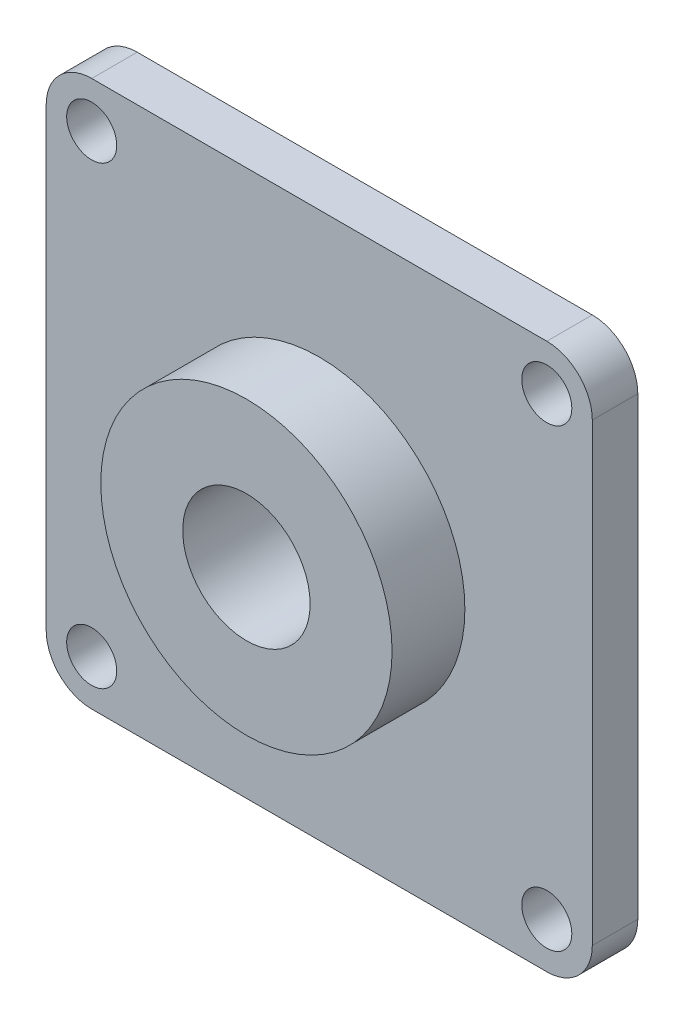
ISO-10303-21;
HEADER;
FILE_DESCRIPTION(('STEP AP214'),'2;1');
FILE_NAME('part.step','',(''),(''),'','','');
FILE_SCHEMA(('AUTOMOTIVE_DESIGN { 1 0 10303 214 1 1 1 1 }'));
ENDSEC;
DATA;
#1=APPLICATION_CONTEXT('core data for automotive mechanical design processes');
#2=APPLICATION_PROTOCOL_DEFINITION('international standard','automotive_design',2000,#1);
#3=PRODUCT_CONTEXT('',#1,'mechanical');
#4=PRODUCT('Part','Part','',(#3));
#5=PRODUCT_RELATED_PRODUCT_CATEGORY('part','',(#4));
#6=PRODUCT_DEFINITION_FORMATION('','',#4);
#7=PRODUCT_DEFINITION_CONTEXT('part definition',#1,'design');
#8=PRODUCT_DEFINITION('design','',#6,#7);
#9=PRODUCT_DEFINITION_SHAPE('','',#8);
#10=(LENGTH_UNIT() NAMED_UNIT(*) SI_UNIT(.MILLI.,.METRE.));
#11=(NAMED_UNIT(*) PLANE_ANGLE_UNIT() SI_UNIT($,.RADIAN.));
#12=(NAMED_UNIT(*) SI_UNIT($,.STERADIAN.) SOLID_ANGLE_UNIT());
#13=UNCERTAINTY_MEASURE_WITH_UNIT(LENGTH_MEASURE(1.E-05),#10,'distance_accuracy_value','');
#14=(GEOMETRIC_REPRESENTATION_CONTEXT(3) GLOBAL_UNCERTAINTY_ASSIGNED_CONTEXT((#13)) GLOBAL_UNIT_ASSIGNED_CONTEXT((#10,
#11,#12)) REPRESENTATION_CONTEXT('',''));
#15=CARTESIAN_POINT('',(0.,0.,0.));
#16=DIRECTION('',(0.,0.,1.));
#17=DIRECTION('',(1.,0.,0.));
#18=AXIS2_PLACEMENT_3D('',#15,#16,#17);
#19=CARTESIAN_POINT('',(-30.,30.,5.));
#20=DIRECTION('',(1.,0.,0.));
#21=DIRECTION('',(0.,1.,0.));
#22=AXIS2_PLACEMENT_3D('',#19,#20,#21);
#23=PLANE('',#22);
#24=DIRECTION('',(0.,-1.,0.));
#25=VECTOR('',#24,1.);
#26=CARTESIAN_POINT('',(-30.,30.,0.));
#27=LINE('',#26,#25);
#28=CARTESIAN_POINT('',(-30.,25.,0.));
#29=VERTEX_POINT('',#28);
#30=CARTESIAN_POINT('',(-30.,-25.,0.));
#31=VERTEX_POINT('',#30);
#32=EDGE_CURVE('E161',#29,#31,#27,.T.);
#33=ORIENTED_EDGE('',*,*,#32,.T.);
#34=DIRECTION('',(0.,0.,-1.));
#35=VECTOR('',#34,1.);
#36=CARTESIAN_POINT('',(-30.,-25.,5.));
#37=LINE('',#36,#35);
#38=CARTESIAN_POINT('',(-30.,-25.,5.));
#39=VERTEX_POINT('',#38);
#40=EDGE_CURVE('E41',#31,#39,#37,.F.);
#41=ORIENTED_EDGE('',*,*,#40,.T.);
#42=DIRECTION('',(0.,-1.,0.));
#43=VECTOR('',#42,1.);
#44=CARTESIAN_POINT('',(-30.,30.,5.));
#45=LINE('',#44,#43);
#46=CARTESIAN_POINT('',(-30.,25.,5.));
#47=VERTEX_POINT('',#46);
#48=EDGE_CURVE('E126',#47,#39,#45,.T.);
#49=ORIENTED_EDGE('',*,*,#48,.F.);
#50=DIRECTION('',(0.,0.,-1.));
#51=VECTOR('',#50,1.);
#52=CARTESIAN_POINT('',(-30.,25.,5.));
#53=LINE('',#52,#51);
#54=EDGE_CURVE('E154',#47,#29,#53,.T.);
#55=ORIENTED_EDGE('',*,*,#54,.T.);
#56=EDGE_LOOP('',(#33,#41,#49,#55));
#57=FACE_BOUND('',#56,.T.);
#58=ADVANCED_FACE('F33',(#57),#23,.F.);
#59=CARTESIAN_POINT('',(30.,-30.,5.));
#60=DIRECTION('',(0.,1.,0.));
#61=DIRECTION('',(-1.,0.,0.));
#62=AXIS2_PLACEMENT_3D('',#59,#60,#61);
#63=PLANE('',#62);
#64=DIRECTION('',(1.,0.,0.));
#65=VECTOR('',#64,1.);
#66=CARTESIAN_POINT('',(30.,-30.,0.));
#67=LINE('',#66,#65);
#68=CARTESIAN_POINT('',(-25.,-30.,0.));
#69=VERTEX_POINT('',#68);
#70=CARTESIAN_POINT('',(25.,-30.,0.));
#71=VERTEX_POINT('',#70);
#72=EDGE_CURVE('E131',#69,#71,#67,.T.);
#73=ORIENTED_EDGE('',*,*,#72,.T.);
#74=DIRECTION('',(0.,0.,-1.));
#75=VECTOR('',#74,1.);
#76=CARTESIAN_POINT('',(25.,-30.,5.));
#77=LINE('',#76,#75);
#78=CARTESIAN_POINT('',(25.,-30.,5.));
#79=VERTEX_POINT('',#78);
#80=EDGE_CURVE('E48',#71,#79,#77,.F.);
#81=ORIENTED_EDGE('',*,*,#80,.T.);
#82=DIRECTION('',(1.,0.,0.));
#83=VECTOR('',#82,1.);
#84=CARTESIAN_POINT('',(30.,-30.,5.));
#85=LINE('',#84,#83);
#86=CARTESIAN_POINT('',(-25.,-30.,5.));
#87=VERTEX_POINT('',#86);
#88=EDGE_CURVE('E129',#87,#79,#85,.T.);
#89=ORIENTED_EDGE('',*,*,#88,.F.);
#90=DIRECTION('',(0.,0.,-1.));
#91=VECTOR('',#90,1.);
#92=CARTESIAN_POINT('',(-25.,-30.,5.));
#93=LINE('',#92,#91);
#94=EDGE_CURVE('E150',#87,#69,#93,.T.);
#95=ORIENTED_EDGE('',*,*,#94,.T.);
#96=EDGE_LOOP('',(#73,#81,#89,#95));
#97=FACE_BOUND('',#96,.T.);
#98=ADVANCED_FACE('F169',(#97),#63,.F.);
#99=CARTESIAN_POINT('',(30.,30.,5.));
#100=DIRECTION('',(-1.,0.,0.));
#101=DIRECTION('',(0.,-1.,0.));
#102=AXIS2_PLACEMENT_3D('',#99,#100,#101);
#103=PLANE('',#102);
#104=DIRECTION('',(0.,1.,0.));
#105=VECTOR('',#104,1.);
#106=CARTESIAN_POINT('',(30.,30.,0.));
#107=LINE('',#106,#105);
#108=CARTESIAN_POINT('',(30.,-25.,0.));
#109=VERTEX_POINT('',#108);
#110=CARTESIAN_POINT('',(30.,25.,0.));
#111=VERTEX_POINT('',#110);
#112=EDGE_CURVE('E127',#109,#111,#107,.T.);
#113=ORIENTED_EDGE('',*,*,#112,.T.);
#114=DIRECTION('',(0.,0.,-1.));
#115=VECTOR('',#114,1.);
#116=CARTESIAN_POINT('',(30.,25.,5.));
#117=LINE('',#116,#115);
#118=CARTESIAN_POINT('',(30.,25.,5.));
#119=VERTEX_POINT('',#118);
#120=EDGE_CURVE('E105',#111,#119,#117,.F.);
#121=ORIENTED_EDGE('',*,*,#120,.T.);
#122=DIRECTION('',(0.,1.,0.));
#123=VECTOR('',#122,1.);
#124=CARTESIAN_POINT('',(30.,30.,5.));
#125=LINE('',#124,#123);
#126=CARTESIAN_POINT('',(30.,-25.,5.));
#127=VERTEX_POINT('',#126);
#128=EDGE_CURVE('E174',#127,#119,#125,.T.);
#129=ORIENTED_EDGE('',*,*,#128,.F.);
#130=DIRECTION('',(0.,0.,-1.));
#131=VECTOR('',#130,1.);
#132=CARTESIAN_POINT('',(30.,-25.,5.));
#133=LINE('',#132,#131);
#134=EDGE_CURVE('E110',#127,#109,#133,.T.);
#135=ORIENTED_EDGE('',*,*,#134,.T.);
#136=EDGE_LOOP('',(#113,#121,#129,#135));
#137=FACE_BOUND('',#136,.T.);
#138=ADVANCED_FACE('F261',(#137),#103,.F.);
#139=CARTESIAN_POINT('',(30.,30.,5.));
#140=DIRECTION('',(0.,-1.,0.));
#141=DIRECTION('',(1.,0.,0.));
#142=AXIS2_PLACEMENT_3D('',#139,#140,#141);
#143=PLANE('',#142);
#144=DIRECTION('',(-1.,0.,0.));
#145=VECTOR('',#144,1.);
#146=CARTESIAN_POINT('',(30.,30.,5.));
#147=LINE('',#146,#145);
#148=CARTESIAN_POINT('',(25.,30.,5.));
#149=VERTEX_POINT('',#148);
#150=CARTESIAN_POINT('',(-25.,30.,5.));
#151=VERTEX_POINT('',#150);
#152=EDGE_CURVE('E120',#149,#151,#147,.T.);
#153=ORIENTED_EDGE('',*,*,#152,.F.);
#154=DIRECTION('',(0.,0.,-1.));
#155=VECTOR('',#154,1.);
#156=CARTESIAN_POINT('',(25.,30.,5.));
#157=LINE('',#156,#155);
#158=CARTESIAN_POINT('',(25.,30.,0.));
#159=VERTEX_POINT('',#158);
#160=EDGE_CURVE('E104',#149,#159,#157,.T.);
#161=ORIENTED_EDGE('',*,*,#160,.T.);
#162=DIRECTION('',(-1.,0.,0.));
#163=VECTOR('',#162,1.);
#164=CARTESIAN_POINT('',(30.,30.,0.));
#165=LINE('',#164,#163);
#166=CARTESIAN_POINT('',(-25.,30.,0.));
#167=VERTEX_POINT('',#166);
#168=EDGE_CURVE('E117',#159,#167,#165,.T.);
#169=ORIENTED_EDGE('',*,*,#168,.T.);
#170=DIRECTION('',(0.,0.,-1.));
#171=VECTOR('',#170,1.);
#172=CARTESIAN_POINT('',(-25.,30.,5.));
#173=LINE('',#172,#171);
#174=EDGE_CURVE('E122',#167,#151,#173,.F.);
#175=ORIENTED_EDGE('',*,*,#174,.T.);
#176=EDGE_LOOP('',(#153,#161,#169,#175));
#177=FACE_BOUND('',#176,.T.);
#178=ADVANCED_FACE('F116',(#177),#143,.F.);
#179=CARTESIAN_POINT('',(0.,0.,5.));
#180=DIRECTION('',(0.,0.,-1.));
#181=DIRECTION('',(-1.,0.,0.));
#182=AXIS2_PLACEMENT_3D('',#179,#180,#181);
#183=PLANE('',#182);
#184=CARTESIAN_POINT('',(0.,0.,5.));
#185=DIRECTION('',(0.,0.,-1.));
#186=DIRECTION('',(-1.,0.,0.));
#187=AXIS2_PLACEMENT_3D('',#184,#185,#186);
#188=CIRCLE('',#187,16.);
#189=CARTESIAN_POINT('',(-16.,0.,5.));
#190=VERTEX_POINT('',#189);
#191=EDGE_CURVE('E11',#190,#190,#188,.F.);
#192=ORIENTED_EDGE('',*,*,#191,.F.);
#193=EDGE_LOOP('',(#192));
#194=FACE_BOUND('',#193,.T.);
#195=CARTESIAN_POINT('',(-24.9999999999995,-25.,5.));
#196=DIRECTION('',(0.,0.,1.));
#197=DIRECTION('',(1.,0.,0.));
#198=AXIS2_PLACEMENT_3D('',#195,#196,#197);
#199=CIRCLE('',#198,2.75);
#200=CARTESIAN_POINT('',(-22.2499999999995,-25.,5.));
#201=VERTEX_POINT('',#200);
#202=EDGE_CURVE('E183',#201,#201,#199,.T.);
#203=ORIENTED_EDGE('',*,*,#202,.F.);
#204=EDGE_LOOP('',(#203));
#205=FACE_BOUND('',#204,.T.);
#206=CARTESIAN_POINT('',(25.0000000000005,-25.,5.));
#207=DIRECTION('',(0.,0.,1.));
#208=DIRECTION('',(1.,0.,0.));
#209=AXIS2_PLACEMENT_3D('',#206,#207,#208);
#210=CIRCLE('',#209,2.75);
#211=CARTESIAN_POINT('',(27.7500000000005,-25.,5.));
#212=VERTEX_POINT('',#211);
#213=EDGE_CURVE('E190',#212,#212,#210,.T.);
#214=ORIENTED_EDGE('',*,*,#213,.F.);
#215=EDGE_LOOP('',(#214));
#216=FACE_BOUND('',#215,.T.);
#217=CARTESIAN_POINT('',(25.,25.,5.));
#218=DIRECTION('',(0.,0.,1.));
#219=DIRECTION('',(1.,0.,0.));
#220=AXIS2_PLACEMENT_3D('',#217,#218,#219);
#221=CIRCLE('',#220,2.75);
#222=CARTESIAN_POINT('',(27.75,25.,5.));
#223=VERTEX_POINT('',#222);
#224=EDGE_CURVE('E196',#223,#223,#221,.T.);
#225=ORIENTED_EDGE('',*,*,#224,.F.);
#226=EDGE_LOOP('',(#225));
#227=FACE_BOUND('',#226,.T.);
#228=CARTESIAN_POINT('',(-25.,25.,5.));
#229=DIRECTION('',(0.,0.,1.));
#230=DIRECTION('',(1.,0.,0.));
#231=AXIS2_PLACEMENT_3D('',#228,#229,#230);
#232=CIRCLE('',#231,2.75);
#233=CARTESIAN_POINT('',(-22.25,25.,5.));
#234=VERTEX_POINT('',#233);
#235=EDGE_CURVE('E177',#234,#234,#232,.T.);
#236=ORIENTED_EDGE('',*,*,#235,.F.);
#237=EDGE_LOOP('',(#236));
#238=FACE_BOUND('',#237,.T.);
#239=ORIENTED_EDGE('',*,*,#128,.T.);
#240=CARTESIAN_POINT('',(25.,25.,5.));
#241=DIRECTION('',(0.,0.,-1.));
#242=DIRECTION('',(-1.,0.,0.));
#243=AXIS2_PLACEMENT_3D('',#240,#241,#242);
#244=CIRCLE('',#243,5.);
#245=EDGE_CURVE('E148',#119,#149,#244,.F.);
#246=ORIENTED_EDGE('',*,*,#245,.T.);
#247=ORIENTED_EDGE('',*,*,#152,.T.);
#248=CARTESIAN_POINT('',(-25.,25.,5.));
#249=DIRECTION('',(0.,0.,-1.));
#250=DIRECTION('',(-1.,0.,0.));
#251=AXIS2_PLACEMENT_3D('',#248,#249,#250);
#252=CIRCLE('',#251,5.);
#253=EDGE_CURVE('E143',#151,#47,#252,.F.);
#254=ORIENTED_EDGE('',*,*,#253,.T.);
#255=ORIENTED_EDGE('',*,*,#48,.T.);
#256=CARTESIAN_POINT('',(-25.,-25.,5.));
#257=DIRECTION('',(0.,0.,-1.));
#258=DIRECTION('',(-1.,0.,0.));
#259=AXIS2_PLACEMENT_3D('',#256,#257,#258);
#260=CIRCLE('',#259,5.);
#261=EDGE_CURVE('E55',#39,#87,#260,.F.);
#262=ORIENTED_EDGE('',*,*,#261,.T.);
#263=ORIENTED_EDGE('',*,*,#88,.T.);
#264=CARTESIAN_POINT('',(25.,-25.,5.));
#265=DIRECTION('',(0.,0.,-1.));
#266=DIRECTION('',(-1.,0.,0.));
#267=AXIS2_PLACEMENT_3D('',#264,#265,#266);
#268=CIRCLE('',#267,5.);
#269=EDGE_CURVE('E146',#79,#127,#268,.F.);
#270=ORIENTED_EDGE('',*,*,#269,.T.);
#271=EDGE_LOOP('',(#239,#246,#247,#254,#255,#262,#263,#270));
#272=FACE_BOUND('',#271,.T.);
#273=ADVANCED_FACE('F164',(#194,#205,#216,#227,#238,#272),#183,.F.);
#274=CARTESIAN_POINT('',(0.,0.,0.));
#275=DIRECTION('',(0.,0.,-1.));
#276=DIRECTION('',(-1.,0.,0.));
#277=AXIS2_PLACEMENT_3D('',#274,#275,#276);
#278=PLANE('',#277);
#279=CARTESIAN_POINT('',(0.,0.,0.));
#280=DIRECTION('',(0.,0.,1.));
#281=DIRECTION('',(1.,0.,0.));
#282=AXIS2_PLACEMENT_3D('',#279,#280,#281);
#283=CIRCLE('',#282,7.);
#284=CARTESIAN_POINT('',(7.,0.,0.));
#285=VERTEX_POINT('',#284);
#286=EDGE_CURVE('E203',#285,#285,#283,.T.);
#287=ORIENTED_EDGE('',*,*,#286,.T.);
#288=EDGE_LOOP('',(#287));
#289=FACE_BOUND('',#288,.T.);
#290=CARTESIAN_POINT('',(-24.9999999999995,-25.,0.));
#291=DIRECTION('',(0.,0.,1.));
#292=DIRECTION('',(1.,0.,0.));
#293=AXIS2_PLACEMENT_3D('',#290,#291,#292);
#294=CIRCLE('',#293,2.75);
#295=CARTESIAN_POINT('',(-22.2499999999995,-25.,0.));
#296=VERTEX_POINT('',#295);
#297=EDGE_CURVE('E186',#296,#296,#294,.T.);
#298=ORIENTED_EDGE('',*,*,#297,.T.);
#299=EDGE_LOOP('',(#298));
#300=FACE_BOUND('',#299,.T.);
#301=CARTESIAN_POINT('',(25.0000000000005,-25.,0.));
#302=DIRECTION('',(0.,0.,1.));
#303=DIRECTION('',(1.,0.,0.));
#304=AXIS2_PLACEMENT_3D('',#301,#302,#303);
#305=CIRCLE('',#304,2.75);
#306=CARTESIAN_POINT('',(27.7500000000005,-25.,0.));
#307=VERTEX_POINT('',#306);
#308=EDGE_CURVE('E193',#307,#307,#305,.T.);
#309=ORIENTED_EDGE('',*,*,#308,.T.);
#310=EDGE_LOOP('',(#309));
#311=FACE_BOUND('',#310,.T.);
#312=CARTESIAN_POINT('',(25.,25.,0.));
#313=DIRECTION('',(0.,0.,1.));
#314=DIRECTION('',(1.,0.,0.));
#315=AXIS2_PLACEMENT_3D('',#312,#313,#314);
#316=CIRCLE('',#315,2.75);
#317=CARTESIAN_POINT('',(27.75,25.,0.));
#318=VERTEX_POINT('',#317);
#319=EDGE_CURVE('E180',#318,#318,#316,.T.);
#320=ORIENTED_EDGE('',*,*,#319,.T.);
#321=EDGE_LOOP('',(#320));
#322=FACE_BOUND('',#321,.T.);
#323=CARTESIAN_POINT('',(-25.,25.,0.));
#324=DIRECTION('',(0.,0.,1.));
#325=DIRECTION('',(1.,0.,0.));
#326=AXIS2_PLACEMENT_3D('',#323,#324,#325);
#327=CIRCLE('',#326,2.75);
#328=CARTESIAN_POINT('',(-22.25,25.,0.));
#329=VERTEX_POINT('',#328);
#330=EDGE_CURVE('E170',#329,#329,#327,.T.);
#331=ORIENTED_EDGE('',*,*,#330,.T.);
#332=EDGE_LOOP('',(#331));
#333=FACE_BOUND('',#332,.T.);
#334=ORIENTED_EDGE('',*,*,#168,.F.);
#335=CARTESIAN_POINT('',(25.,25.,0.));
#336=DIRECTION('',(0.,0.,-1.));
#337=DIRECTION('',(-1.,0.,0.));
#338=AXIS2_PLACEMENT_3D('',#335,#336,#337);
#339=CIRCLE('',#338,5.);
#340=EDGE_CURVE('E100',#159,#111,#339,.T.);
#341=ORIENTED_EDGE('',*,*,#340,.T.);
#342=ORIENTED_EDGE('',*,*,#112,.F.);
#343=CARTESIAN_POINT('',(25.,-25.,0.));
#344=DIRECTION('',(0.,0.,-1.));
#345=DIRECTION('',(-1.,0.,0.));
#346=AXIS2_PLACEMENT_3D('',#343,#344,#345);
#347=CIRCLE('',#346,5.);
#348=EDGE_CURVE('E111',#109,#71,#347,.T.);
#349=ORIENTED_EDGE('',*,*,#348,.T.);
#350=ORIENTED_EDGE('',*,*,#72,.F.);
#351=CARTESIAN_POINT('',(-25.,-25.,0.));
#352=DIRECTION('',(0.,0.,-1.));
#353=DIRECTION('',(-1.,0.,0.));
#354=AXIS2_PLACEMENT_3D('',#351,#352,#353);
#355=CIRCLE('',#354,5.);
#356=EDGE_CURVE('E137',#69,#31,#355,.T.);
#357=ORIENTED_EDGE('',*,*,#356,.T.);
#358=ORIENTED_EDGE('',*,*,#32,.F.);
#359=CARTESIAN_POINT('',(-25.,25.,0.));
#360=DIRECTION('',(0.,0.,-1.));
#361=DIRECTION('',(-1.,0.,0.));
#362=AXIS2_PLACEMENT_3D('',#359,#360,#361);
#363=CIRCLE('',#362,5.);
#364=EDGE_CURVE('E121',#29,#167,#363,.T.);
#365=ORIENTED_EDGE('',*,*,#364,.T.);
#366=EDGE_LOOP('',(#334,#341,#342,#349,#350,#357,#358,#365));
#367=FACE_BOUND('',#366,.T.);
#368=ADVANCED_FACE('F124',(#289,#300,#311,#322,#333,#367),#278,.T.);
#369=CARTESIAN_POINT('',(-25.,25.,0.));
#370=DIRECTION('',(0.,0.,1.));
#371=DIRECTION('',(1.,0.,0.));
#372=AXIS2_PLACEMENT_3D('',#369,#370,#371);
#373=CYLINDRICAL_SURFACE('',#372,2.75);
#374=ORIENTED_EDGE('',*,*,#330,.F.);
#375=EDGE_LOOP('',(#374));
#376=FACE_BOUND('',#375,.T.);
#377=ORIENTED_EDGE('',*,*,#235,.T.);
#378=EDGE_LOOP('',(#377));
#379=FACE_BOUND('',#378,.T.);
#380=ADVANCED_FACE('F241',(#376,#379),#373,.F.);
#381=CARTESIAN_POINT('',(25.,25.,0.));
#382=DIRECTION('',(0.,0.,1.));
#383=DIRECTION('',(1.,0.,0.));
#384=AXIS2_PLACEMENT_3D('',#381,#382,#383);
#385=CYLINDRICAL_SURFACE('',#384,2.75);
#386=ORIENTED_EDGE('',*,*,#319,.F.);
#387=EDGE_LOOP('',(#386));
#388=FACE_BOUND('',#387,.T.);
#389=ORIENTED_EDGE('',*,*,#224,.T.);
#390=EDGE_LOOP('',(#389));
#391=FACE_BOUND('',#390,.T.);
#392=ADVANCED_FACE('F243',(#388,#391),#385,.F.);
#393=CARTESIAN_POINT('',(25.0000000000005,-25.,0.));
#394=DIRECTION('',(0.,0.,1.));
#395=DIRECTION('',(1.,0.,0.));
#396=AXIS2_PLACEMENT_3D('',#393,#394,#395);
#397=CYLINDRICAL_SURFACE('',#396,2.75);
#398=ORIENTED_EDGE('',*,*,#308,.F.);
#399=EDGE_LOOP('',(#398));
#400=FACE_BOUND('',#399,.T.);
#401=ORIENTED_EDGE('',*,*,#213,.T.);
#402=EDGE_LOOP('',(#401));
#403=FACE_BOUND('',#402,.T.);
#404=ADVANCED_FACE('F250',(#400,#403),#397,.F.);
#405=CARTESIAN_POINT('',(-24.9999999999995,-25.,0.));
#406=DIRECTION('',(0.,0.,1.));
#407=DIRECTION('',(1.,0.,0.));
#408=AXIS2_PLACEMENT_3D('',#405,#406,#407);
#409=CYLINDRICAL_SURFACE('',#408,2.75);
#410=ORIENTED_EDGE('',*,*,#297,.F.);
#411=EDGE_LOOP('',(#410));
#412=FACE_BOUND('',#411,.T.);
#413=ORIENTED_EDGE('',*,*,#202,.T.);
#414=EDGE_LOOP('',(#413));
#415=FACE_BOUND('',#414,.T.);
#416=ADVANCED_FACE('F268',(#412,#415),#409,.F.);
#417=CARTESIAN_POINT('',(25.,25.,5.));
#418=DIRECTION('',(0.,0.,-1.));
#419=DIRECTION('',(-1.,0.,0.));
#420=AXIS2_PLACEMENT_3D('',#417,#418,#419);
#421=CYLINDRICAL_SURFACE('',#420,5.);
#422=ORIENTED_EDGE('',*,*,#245,.F.);
#423=ORIENTED_EDGE('',*,*,#120,.F.);
#424=ORIENTED_EDGE('',*,*,#340,.F.);
#425=ORIENTED_EDGE('',*,*,#160,.F.);
#426=EDGE_LOOP('',(#422,#423,#424,#425));
#427=FACE_BOUND('',#426,.T.);
#428=ADVANCED_FACE('F103',(#427),#421,.T.);
#429=CARTESIAN_POINT('',(25.,-25.,5.));
#430=DIRECTION('',(0.,0.,-1.));
#431=DIRECTION('',(-1.,0.,0.));
#432=AXIS2_PLACEMENT_3D('',#429,#430,#431);
#433=CYLINDRICAL_SURFACE('',#432,5.);
#434=ORIENTED_EDGE('',*,*,#269,.F.);
#435=ORIENTED_EDGE('',*,*,#80,.F.);
#436=ORIENTED_EDGE('',*,*,#348,.F.);
#437=ORIENTED_EDGE('',*,*,#134,.F.);
#438=EDGE_LOOP('',(#434,#435,#436,#437));
#439=FACE_BOUND('',#438,.T.);
#440=ADVANCED_FACE('F267',(#439),#433,.T.);
#441=CARTESIAN_POINT('',(-25.,-25.,5.));
#442=DIRECTION('',(0.,0.,-1.));
#443=DIRECTION('',(-1.,0.,0.));
#444=AXIS2_PLACEMENT_3D('',#441,#442,#443);
#445=CYLINDRICAL_SURFACE('',#444,5.);
#446=ORIENTED_EDGE('',*,*,#261,.F.);
#447=ORIENTED_EDGE('',*,*,#40,.F.);
#448=ORIENTED_EDGE('',*,*,#356,.F.);
#449=ORIENTED_EDGE('',*,*,#94,.F.);
#450=EDGE_LOOP('',(#446,#447,#448,#449));
#451=FACE_BOUND('',#450,.T.);
#452=ADVANCED_FACE('F167',(#451),#445,.T.);
#453=CARTESIAN_POINT('',(-25.,25.,5.));
#454=DIRECTION('',(0.,0.,-1.));
#455=DIRECTION('',(-1.,0.,0.));
#456=AXIS2_PLACEMENT_3D('',#453,#454,#455);
#457=CYLINDRICAL_SURFACE('',#456,5.);
#458=ORIENTED_EDGE('',*,*,#253,.F.);
#459=ORIENTED_EDGE('',*,*,#174,.F.);
#460=ORIENTED_EDGE('',*,*,#364,.F.);
#461=ORIENTED_EDGE('',*,*,#54,.F.);
#462=EDGE_LOOP('',(#458,#459,#460,#461));
#463=FACE_BOUND('',#462,.T.);
#464=ADVANCED_FACE('F35',(#463),#457,.T.);
#465=CARTESIAN_POINT('',(0.,0.,13.));
#466=DIRECTION('',(0.,0.,-1.));
#467=DIRECTION('',(-1.,0.,0.));
#468=AXIS2_PLACEMENT_3D('',#465,#466,#467);
#469=CYLINDRICAL_SURFACE('',#468,16.);
#470=CARTESIAN_POINT('',(0.,0.,13.));
#471=DIRECTION('',(0.,0.,1.));
#472=DIRECTION('',(1.,0.,0.));
#473=AXIS2_PLACEMENT_3D('',#470,#471,#472);
#474=CIRCLE('',#473,16.);
#475=CARTESIAN_POINT('',(16.,0.,13.));
#476=VERTEX_POINT('',#475);
#477=EDGE_CURVE('E187',#476,#476,#474,.T.);
#478=ORIENTED_EDGE('',*,*,#477,.F.);
#479=EDGE_LOOP('',(#478));
#480=FACE_BOUND('',#479,.T.);
#481=ORIENTED_EDGE('',*,*,#191,.T.);
#482=EDGE_LOOP('',(#481));
#483=FACE_BOUND('',#482,.T.);
#484=ADVANCED_FACE('F221',(#480,#483),#469,.T.);
#485=CARTESIAN_POINT('',(0.,0.,13.));
#486=DIRECTION('',(0.,0.,1.));
#487=DIRECTION('',(1.,0.,0.));
#488=AXIS2_PLACEMENT_3D('',#485,#486,#487);
#489=PLANE('',#488);
#490=CARTESIAN_POINT('',(0.,0.,13.));
#491=DIRECTION('',(0.,0.,1.));
#492=DIRECTION('',(1.,0.,0.));
#493=AXIS2_PLACEMENT_3D('',#490,#491,#492);
#494=CIRCLE('',#493,7.);
#495=CARTESIAN_POINT('',(7.,0.,13.));
#496=VERTEX_POINT('',#495);
#497=EDGE_CURVE('E204',#496,#496,#494,.T.);
#498=ORIENTED_EDGE('',*,*,#497,.F.);
#499=EDGE_LOOP('',(#498));
#500=FACE_BOUND('',#499,.T.);
#501=ORIENTED_EDGE('',*,*,#477,.T.);
#502=EDGE_LOOP('',(#501));
#503=FACE_BOUND('',#502,.T.);
#504=ADVANCED_FACE('F215',(#500,#503),#489,.T.);
#505=CARTESIAN_POINT('',(0.,0.,0.));
#506=DIRECTION('',(0.,0.,1.));
#507=DIRECTION('',(1.,0.,0.));
#508=AXIS2_PLACEMENT_3D('',#505,#506,#507);
#509=CYLINDRICAL_SURFACE('',#508,7.);
#510=ORIENTED_EDGE('',*,*,#286,.F.);
#511=EDGE_LOOP('',(#510));
#512=FACE_BOUND('',#511,.T.);
#513=ORIENTED_EDGE('',*,*,#497,.T.);
#514=EDGE_LOOP('',(#513));
#515=FACE_BOUND('',#514,.T.);
#516=ADVANCED_FACE('F212',(#512,#515),#509,.F.);
#517=CLOSED_SHELL('',(#58,#98,#138,#178,#273,#368,#380,#392,#404,#416,#428,#440,#452,#464,#484,
#504,#516));
#518=MANIFOLD_SOLID_BREP('B2',#517);
#519=ADVANCED_BREP_SHAPE_REPRESENTATION('',(#18,#518),#14);
#520=SHAPE_DEFINITION_REPRESENTATION(#9,#519);
ENDSEC;
END-ISO-10303-21;
